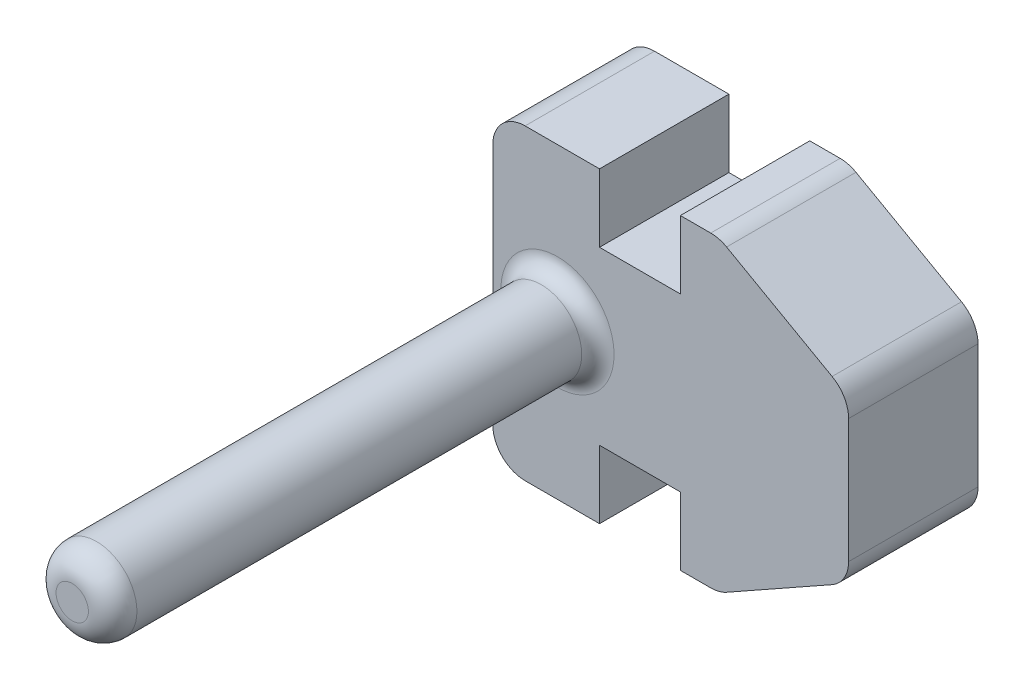
ISO-10303-21;
HEADER;
FILE_DESCRIPTION(('STEP AP214'),'2;1');
FILE_NAME('part.step','',(''),(''),'','','');
FILE_SCHEMA(('AUTOMOTIVE_DESIGN { 1 0 10303 214 1 1 1 1 }'));
ENDSEC;
DATA;
#1=APPLICATION_CONTEXT('core data for automotive mechanical design processes');
#2=APPLICATION_PROTOCOL_DEFINITION('international standard','automotive_design',2000,#1);
#3=PRODUCT_CONTEXT('',#1,'mechanical');
#4=PRODUCT('Part','Part','',(#3));
#5=PRODUCT_RELATED_PRODUCT_CATEGORY('part','',(#4));
#6=PRODUCT_DEFINITION_FORMATION('','',#4);
#7=PRODUCT_DEFINITION_CONTEXT('part definition',#1,'design');
#8=PRODUCT_DEFINITION('design','',#6,#7);
#9=PRODUCT_DEFINITION_SHAPE('','',#8);
#10=(LENGTH_UNIT() NAMED_UNIT(*) SI_UNIT(.MILLI.,.METRE.));
#11=(NAMED_UNIT(*) PLANE_ANGLE_UNIT() SI_UNIT($,.RADIAN.));
#12=(NAMED_UNIT(*) SI_UNIT($,.STERADIAN.) SOLID_ANGLE_UNIT());
#13=UNCERTAINTY_MEASURE_WITH_UNIT(LENGTH_MEASURE(1.E-05),#10,'distance_accuracy_value','');
#14=(GEOMETRIC_REPRESENTATION_CONTEXT(3) GLOBAL_UNCERTAINTY_ASSIGNED_CONTEXT((#13)) GLOBAL_UNIT_ASSIGNED_CONTEXT((#10,
#11,#12)) REPRESENTATION_CONTEXT('',''));
#15=CARTESIAN_POINT('',(0.,0.,0.));
#16=DIRECTION('',(0.,0.,1.));
#17=DIRECTION('',(1.,0.,0.));
#18=AXIS2_PLACEMENT_3D('',#15,#16,#17);
#19=CARTESIAN_POINT('',(2.3,0.,4.));
#20=DIRECTION('',(-1.,0.,0.));
#21=DIRECTION('',(0.,0.,1.));
#22=AXIS2_PLACEMENT_3D('',#19,#20,#21);
#23=PLANE('',#22);
#24=DIRECTION('',(0.,1.,0.));
#25=VECTOR('',#24,1.);
#26=CARTESIAN_POINT('',(2.3,0.,0.));
#27=LINE('',#26,#25);
#28=CARTESIAN_POINT('',(2.3,-4.75,0.));
#29=VERTEX_POINT('',#28);
#30=CARTESIAN_POINT('',(2.3,-2.65,0.));
#31=VERTEX_POINT('',#30);
#32=EDGE_CURVE('E194',#29,#31,#27,.T.);
#33=ORIENTED_EDGE('',*,*,#32,.F.);
#34=DIRECTION('',(0.,0.,-1.));
#35=VECTOR('',#34,1.);
#36=CARTESIAN_POINT('',(2.3,-4.75,4.));
#37=LINE('',#36,#35);
#38=CARTESIAN_POINT('',(2.3,-4.75,4.));
#39=VERTEX_POINT('',#38);
#40=EDGE_CURVE('E181',#39,#29,#37,.T.);
#41=ORIENTED_EDGE('',*,*,#40,.F.);
#42=DIRECTION('',(0.,1.,0.));
#43=VECTOR('',#42,1.);
#44=CARTESIAN_POINT('',(2.3,0.,4.));
#45=LINE('',#44,#43);
#46=CARTESIAN_POINT('',(2.3,-2.65,4.));
#47=VERTEX_POINT('',#46);
#48=EDGE_CURVE('E188',#39,#47,#45,.T.);
#49=ORIENTED_EDGE('',*,*,#48,.T.);
#50=DIRECTION('',(0.,0.,-1.));
#51=VECTOR('',#50,1.);
#52=CARTESIAN_POINT('',(2.3,-2.65,4.));
#53=LINE('',#52,#51);
#54=EDGE_CURVE('E227',#47,#31,#53,.T.);
#55=ORIENTED_EDGE('',*,*,#54,.T.);
#56=EDGE_LOOP('',(#33,#41,#49,#55));
#57=FACE_BOUND('',#56,.T.);
#58=ADVANCED_FACE('F38',(#57),#23,.T.);
#59=CARTESIAN_POINT('',(0.,-4.75,4.));
#60=DIRECTION('',(0.,-1.,0.));
#61=DIRECTION('',(1.,0.,0.));
#62=AXIS2_PLACEMENT_3D('',#59,#60,#61);
#63=PLANE('',#62);
#64=DIRECTION('',(-1.,0.,0.));
#65=VECTOR('',#64,1.);
#66=CARTESIAN_POINT('',(0.,-4.75,0.));
#67=LINE('',#66,#65);
#68=CARTESIAN_POINT('',(3.23804891659047,-4.75,0.));
#69=VERTEX_POINT('',#68);
#70=EDGE_CURVE('E229',#69,#29,#67,.T.);
#71=ORIENTED_EDGE('',*,*,#70,.F.);
#72=DIRECTION('',(0.,0.,-1.));
#73=VECTOR('',#72,1.);
#74=CARTESIAN_POINT('',(3.23804891659047,-4.75,4.));
#75=LINE('',#74,#73);
#76=CARTESIAN_POINT('',(3.23804891659047,-4.75,4.));
#77=VERTEX_POINT('',#76);
#78=EDGE_CURVE('E184',#69,#77,#75,.F.);
#79=ORIENTED_EDGE('',*,*,#78,.T.);
#80=DIRECTION('',(-1.,0.,0.));
#81=VECTOR('',#80,1.);
#82=CARTESIAN_POINT('',(0.,-4.75,4.));
#83=LINE('',#82,#81);
#84=EDGE_CURVE('E177',#77,#39,#83,.T.);
#85=ORIENTED_EDGE('',*,*,#84,.T.);
#86=ORIENTED_EDGE('',*,*,#40,.T.);
#87=EDGE_LOOP('',(#71,#79,#85,#86));
#88=FACE_BOUND('',#87,.T.);
#89=ADVANCED_FACE('F180',(#88),#63,.T.);
#90=CARTESIAN_POINT('',(0.,4.75,4.));
#91=DIRECTION('',(0.,-1.,0.));
#92=DIRECTION('',(0.,0.,-1.));
#93=AXIS2_PLACEMENT_3D('',#90,#91,#92);
#94=PLANE('',#93);
#95=DIRECTION('',(-1.,0.,0.));
#96=VECTOR('',#95,1.);
#97=CARTESIAN_POINT('',(0.,4.75,4.));
#98=LINE('',#97,#96);
#99=CARTESIAN_POINT('',(3.23804891659046,4.75,4.));
#100=VERTEX_POINT('',#99);
#101=CARTESIAN_POINT('',(2.3,4.75,4.));
#102=VERTEX_POINT('',#101);
#103=EDGE_CURVE('E187',#100,#102,#98,.T.);
#104=ORIENTED_EDGE('',*,*,#103,.F.);
#105=DIRECTION('',(0.,0.,-1.));
#106=VECTOR('',#105,1.);
#107=CARTESIAN_POINT('',(3.23804891659046,4.75,0.));
#108=LINE('',#107,#106);
#109=CARTESIAN_POINT('',(3.23804891659046,4.75,0.));
#110=VERTEX_POINT('',#109);
#111=EDGE_CURVE('E195',#100,#110,#108,.T.);
#112=ORIENTED_EDGE('',*,*,#111,.T.);
#113=DIRECTION('',(-1.,0.,0.));
#114=VECTOR('',#113,1.);
#115=CARTESIAN_POINT('',(0.,4.75,0.));
#116=LINE('',#115,#114);
#117=CARTESIAN_POINT('',(2.3,4.75,0.));
#118=VERTEX_POINT('',#117);
#119=EDGE_CURVE('E232',#110,#118,#116,.T.);
#120=ORIENTED_EDGE('',*,*,#119,.T.);
#121=DIRECTION('',(0.,0.,-1.));
#122=VECTOR('',#121,1.);
#123=CARTESIAN_POINT('',(2.3,4.75,4.));
#124=LINE('',#123,#122);
#125=EDGE_CURVE('E196',#102,#118,#124,.T.);
#126=ORIENTED_EDGE('',*,*,#125,.F.);
#127=EDGE_LOOP('',(#104,#112,#120,#126));
#128=FACE_BOUND('',#127,.T.);
#129=ADVANCED_FACE('F337',(#128),#94,.F.);
#130=CARTESIAN_POINT('',(2.3,0.,4.));
#131=DIRECTION('',(1.,0.,0.));
#132=DIRECTION('',(0.,1.,0.));
#133=AXIS2_PLACEMENT_3D('',#130,#131,#132);
#134=PLANE('',#133);
#135=DIRECTION('',(0.,-1.,0.));
#136=VECTOR('',#135,1.);
#137=CARTESIAN_POINT('',(2.3,0.,0.));
#138=LINE('',#137,#136);
#139=CARTESIAN_POINT('',(2.3,2.65,0.));
#140=VERTEX_POINT('',#139);
#141=EDGE_CURVE('E235',#118,#140,#138,.T.);
#142=ORIENTED_EDGE('',*,*,#141,.T.);
#143=DIRECTION('',(0.,0.,-1.));
#144=VECTOR('',#143,1.);
#145=CARTESIAN_POINT('',(2.3,2.65,4.));
#146=LINE('',#145,#144);
#147=CARTESIAN_POINT('',(2.3,2.65,4.));
#148=VERTEX_POINT('',#147);
#149=EDGE_CURVE('E259',#148,#140,#146,.T.);
#150=ORIENTED_EDGE('',*,*,#149,.F.);
#151=DIRECTION('',(0.,-1.,0.));
#152=VECTOR('',#151,1.);
#153=CARTESIAN_POINT('',(2.3,0.,4.));
#154=LINE('',#153,#152);
#155=EDGE_CURVE('E213',#102,#148,#154,.T.);
#156=ORIENTED_EDGE('',*,*,#155,.F.);
#157=ORIENTED_EDGE('',*,*,#125,.T.);
#158=EDGE_LOOP('',(#142,#150,#156,#157));
#159=FACE_BOUND('',#158,.T.);
#160=ADVANCED_FACE('F342',(#159),#134,.F.);
#161=CARTESIAN_POINT('',(0.,2.65,4.));
#162=DIRECTION('',(0.,1.,0.));
#163=DIRECTION('',(-1.,0.,0.));
#164=AXIS2_PLACEMENT_3D('',#161,#162,#163);
#165=PLANE('',#164);
#166=DIRECTION('',(1.,0.,0.));
#167=VECTOR('',#166,1.);
#168=CARTESIAN_POINT('',(0.,2.65,0.));
#169=LINE('',#168,#167);
#170=CARTESIAN_POINT('',(-0.2,2.65,0.));
#171=VERTEX_POINT('',#170);
#172=EDGE_CURVE('E239',#171,#140,#169,.T.);
#173=ORIENTED_EDGE('',*,*,#172,.F.);
#174=DIRECTION('',(0.,0.,-1.));
#175=VECTOR('',#174,1.);
#176=CARTESIAN_POINT('',(-0.2,2.65,4.));
#177=LINE('',#176,#175);
#178=CARTESIAN_POINT('',(-0.2,2.65,4.));
#179=VERTEX_POINT('',#178);
#180=EDGE_CURVE('E257',#179,#171,#177,.T.);
#181=ORIENTED_EDGE('',*,*,#180,.F.);
#182=DIRECTION('',(1.,0.,0.));
#183=VECTOR('',#182,1.);
#184=CARTESIAN_POINT('',(0.,2.65,4.));
#185=LINE('',#184,#183);
#186=EDGE_CURVE('E216',#179,#148,#185,.T.);
#187=ORIENTED_EDGE('',*,*,#186,.T.);
#188=ORIENTED_EDGE('',*,*,#149,.T.);
#189=EDGE_LOOP('',(#173,#181,#187,#188));
#190=FACE_BOUND('',#189,.T.);
#191=ADVANCED_FACE('F437',(#190),#165,.T.);
#192=CARTESIAN_POINT('',(-0.2,0.,4.));
#193=DIRECTION('',(1.,0.,0.));
#194=DIRECTION('',(0.,1.,0.));
#195=AXIS2_PLACEMENT_3D('',#192,#193,#194);
#196=PLANE('',#195);
#197=DIRECTION('',(0.,-1.,0.));
#198=VECTOR('',#197,1.);
#199=CARTESIAN_POINT('',(-0.2,0.,0.));
#200=LINE('',#199,#198);
#201=CARTESIAN_POINT('',(-0.200000000000001,4.75,0.));
#202=VERTEX_POINT('',#201);
#203=EDGE_CURVE('E242',#202,#171,#200,.T.);
#204=ORIENTED_EDGE('',*,*,#203,.F.);
#205=DIRECTION('',(0.,0.,-1.));
#206=VECTOR('',#205,1.);
#207=CARTESIAN_POINT('',(-0.200000000000001,4.75,4.));
#208=LINE('',#207,#206);
#209=CARTESIAN_POINT('',(-0.200000000000001,4.75,4.));
#210=VERTEX_POINT('',#209);
#211=EDGE_CURVE('E255',#210,#202,#208,.T.);
#212=ORIENTED_EDGE('',*,*,#211,.F.);
#213=DIRECTION('',(0.,-1.,0.));
#214=VECTOR('',#213,1.);
#215=CARTESIAN_POINT('',(-0.2,0.,4.));
#216=LINE('',#215,#214);
#217=EDGE_CURVE('E219',#210,#179,#216,.T.);
#218=ORIENTED_EDGE('',*,*,#217,.T.);
#219=ORIENTED_EDGE('',*,*,#180,.T.);
#220=EDGE_LOOP('',(#204,#212,#218,#219));
#221=FACE_BOUND('',#220,.T.);
#222=ADVANCED_FACE('F432',(#221),#196,.T.);
#223=CARTESIAN_POINT('',(-2.5,4.75,0.));
#224=VERTEX_POINT('',#223);
#225=EDGE_CURVE('E236',#202,#224,#116,.T.);
#226=ORIENTED_EDGE('',*,*,#225,.T.);
#227=DIRECTION('',(0.,0.,-1.));
#228=VECTOR('',#227,1.);
#229=CARTESIAN_POINT('',(-2.5,4.75,4.));
#230=LINE('',#229,#228);
#231=CARTESIAN_POINT('',(-2.5,4.75,4.));
#232=VERTEX_POINT('',#231);
#233=EDGE_CURVE('E311',#224,#232,#230,.F.);
#234=ORIENTED_EDGE('',*,*,#233,.T.);
#235=EDGE_CURVE('E214',#210,#232,#98,.T.);
#236=ORIENTED_EDGE('',*,*,#235,.F.);
#237=ORIENTED_EDGE('',*,*,#211,.T.);
#238=EDGE_LOOP('',(#226,#234,#236,#237));
#239=FACE_BOUND('',#238,.T.);
#240=ADVANCED_FACE('F436',(#239),#94,.F.);
#241=CARTESIAN_POINT('',(-3.5,0.,4.));
#242=DIRECTION('',(-1.,0.,0.));
#243=DIRECTION('',(0.,0.,1.));
#244=AXIS2_PLACEMENT_3D('',#241,#242,#243);
#245=PLANE('',#244);
#246=DIRECTION('',(0.,1.,0.));
#247=VECTOR('',#246,1.);
#248=CARTESIAN_POINT('',(-3.5,0.,0.));
#249=LINE('',#248,#247);
#250=CARTESIAN_POINT('',(-3.5,-3.75,0.));
#251=VERTEX_POINT('',#250);
#252=CARTESIAN_POINT('',(-3.5,3.75,0.));
#253=VERTEX_POINT('',#252);
#254=EDGE_CURVE('E245',#251,#253,#249,.T.);
#255=ORIENTED_EDGE('',*,*,#254,.F.);
#256=DIRECTION('',(0.,0.,-1.));
#257=VECTOR('',#256,1.);
#258=CARTESIAN_POINT('',(-3.5,-3.75,4.));
#259=LINE('',#258,#257);
#260=CARTESIAN_POINT('',(-3.5,-3.75,4.));
#261=VERTEX_POINT('',#260);
#262=EDGE_CURVE('E309',#251,#261,#259,.F.);
#263=ORIENTED_EDGE('',*,*,#262,.T.);
#264=DIRECTION('',(0.,1.,0.));
#265=VECTOR('',#264,1.);
#266=CARTESIAN_POINT('',(-3.5,0.,4.));
#267=LINE('',#266,#265);
#268=CARTESIAN_POINT('',(-3.5,3.75,4.));
#269=VERTEX_POINT('',#268);
#270=EDGE_CURVE('E222',#261,#269,#267,.T.);
#271=ORIENTED_EDGE('',*,*,#270,.T.);
#272=DIRECTION('',(0.,0.,-1.));
#273=VECTOR('',#272,1.);
#274=CARTESIAN_POINT('',(-3.5,3.75,0.));
#275=LINE('',#274,#273);
#276=EDGE_CURVE('E306',#269,#253,#275,.T.);
#277=ORIENTED_EDGE('',*,*,#276,.T.);
#278=EDGE_LOOP('',(#255,#263,#271,#277));
#279=FACE_BOUND('',#278,.T.);
#280=ADVANCED_FACE('F372',(#279),#245,.T.);
#281=CARTESIAN_POINT('',(-0.200000000000001,-4.75,4.));
#282=VERTEX_POINT('',#281);
#283=CARTESIAN_POINT('',(-2.5,-4.75,4.));
#284=VERTEX_POINT('',#283);
#285=EDGE_CURVE('E190',#282,#284,#83,.T.);
#286=ORIENTED_EDGE('',*,*,#285,.T.);
#287=DIRECTION('',(0.,0.,-1.));
#288=VECTOR('',#287,1.);
#289=CARTESIAN_POINT('',(-2.5,-4.75,4.));
#290=LINE('',#289,#288);
#291=CARTESIAN_POINT('',(-2.5,-4.75,0.));
#292=VERTEX_POINT('',#291);
#293=EDGE_CURVE('E303',#284,#292,#290,.T.);
#294=ORIENTED_EDGE('',*,*,#293,.T.);
#295=CARTESIAN_POINT('',(-0.200000000000001,-4.75,0.));
#296=VERTEX_POINT('',#295);
#297=EDGE_CURVE('E233',#296,#292,#67,.T.);
#298=ORIENTED_EDGE('',*,*,#297,.F.);
#299=DIRECTION('',(0.,0.,-1.));
#300=VECTOR('',#299,1.);
#301=CARTESIAN_POINT('',(-0.200000000000001,-4.75,4.));
#302=LINE('',#301,#300);
#303=EDGE_CURVE('E253',#282,#296,#302,.T.);
#304=ORIENTED_EDGE('',*,*,#303,.F.);
#305=EDGE_LOOP('',(#286,#294,#298,#304));
#306=FACE_BOUND('',#305,.T.);
#307=ADVANCED_FACE('F339',(#306),#63,.T.);
#308=CARTESIAN_POINT('',(-0.200000000000001,0.,4.));
#309=DIRECTION('',(-1.,0.,0.));
#310=DIRECTION('',(0.,0.,1.));
#311=AXIS2_PLACEMENT_3D('',#308,#309,#310);
#312=PLANE('',#311);
#313=DIRECTION('',(0.,1.,0.));
#314=VECTOR('',#313,1.);
#315=CARTESIAN_POINT('',(-0.200000000000001,0.,0.));
#316=LINE('',#315,#314);
#317=CARTESIAN_POINT('',(-0.200000000000001,-2.65,0.));
#318=VERTEX_POINT('',#317);
#319=EDGE_CURVE('E206',#296,#318,#316,.T.);
#320=ORIENTED_EDGE('',*,*,#319,.T.);
#321=DIRECTION('',(0.,0.,-1.));
#322=VECTOR('',#321,1.);
#323=CARTESIAN_POINT('',(-0.200000000000001,-2.65,4.));
#324=LINE('',#323,#322);
#325=CARTESIAN_POINT('',(-0.200000000000001,-2.65,4.));
#326=VERTEX_POINT('',#325);
#327=EDGE_CURVE('E250',#326,#318,#324,.T.);
#328=ORIENTED_EDGE('',*,*,#327,.F.);
#329=DIRECTION('',(0.,1.,0.));
#330=VECTOR('',#329,1.);
#331=CARTESIAN_POINT('',(-0.200000000000001,0.,4.));
#332=LINE('',#331,#330);
#333=EDGE_CURVE('E224',#282,#326,#332,.T.);
#334=ORIENTED_EDGE('',*,*,#333,.F.);
#335=ORIENTED_EDGE('',*,*,#303,.T.);
#336=EDGE_LOOP('',(#320,#328,#334,#335));
#337=FACE_BOUND('',#336,.T.);
#338=ADVANCED_FACE('F387',(#337),#312,.F.);
#339=CARTESIAN_POINT('',(0.,-2.65,4.));
#340=DIRECTION('',(0.,1.,0.));
#341=DIRECTION('',(0.,0.,1.));
#342=AXIS2_PLACEMENT_3D('',#339,#340,#341);
#343=PLANE('',#342);
#344=DIRECTION('',(1.,0.,0.));
#345=VECTOR('',#344,1.);
#346=CARTESIAN_POINT('',(0.,-2.65,0.));
#347=LINE('',#346,#345);
#348=EDGE_CURVE('E203',#318,#31,#347,.T.);
#349=ORIENTED_EDGE('',*,*,#348,.T.);
#350=ORIENTED_EDGE('',*,*,#54,.F.);
#351=DIRECTION('',(1.,0.,0.));
#352=VECTOR('',#351,1.);
#353=CARTESIAN_POINT('',(0.,-2.65,4.));
#354=LINE('',#353,#352);
#355=EDGE_CURVE('E201',#326,#47,#354,.T.);
#356=ORIENTED_EDGE('',*,*,#355,.F.);
#357=ORIENTED_EDGE('',*,*,#327,.T.);
#358=EDGE_LOOP('',(#349,#350,#356,#357));
#359=FACE_BOUND('',#358,.T.);
#360=ADVANCED_FACE('F390',(#359),#343,.F.);
#361=CARTESIAN_POINT('',(0.,0.,4.));
#362=DIRECTION('',(0.,0.,1.));
#363=DIRECTION('',(1.,0.,0.));
#364=AXIS2_PLACEMENT_3D('',#361,#362,#363);
#365=PLANE('',#364);
#366=CARTESIAN_POINT('',(-1.5,0.,4.));
#367=DIRECTION('',(0.,0.,1.));
#368=DIRECTION('',(1.,0.,0.));
#369=AXIS2_PLACEMENT_3D('',#366,#367,#368);
#370=CIRCLE('',#369,1.75);
#371=CARTESIAN_POINT('',(0.25,0.,4.));
#372=VERTEX_POINT('',#371);
#373=EDGE_CURVE('E316',#372,#372,#370,.F.);
#374=ORIENTED_EDGE('',*,*,#373,.T.);
#375=EDGE_LOOP('',(#374));
#376=FACE_BOUND('',#375,.T.);
#377=DIRECTION('',(0.871575537124549,-0.490261239632559,0.));
#378=VECTOR('',#377,1.);
#379=CARTESIAN_POINT('',(2.87091988130564,5.10385756676558,4.));
#380=LINE('',#379,#378);
#381=CARTESIAN_POINT('',(3.72831015622302,4.62157553712455,4.));
#382=VERTEX_POINT('',#381);
#383=CARTESIAN_POINT('',(6.99026123963256,2.78672805270669,4.));
#384=VERTEX_POINT('',#383);
#385=EDGE_CURVE('E230',#382,#384,#380,.T.);
#386=ORIENTED_EDGE('',*,*,#385,.F.);
#387=CARTESIAN_POINT('',(3.23804891659046,3.75,4.));
#388=DIRECTION('',(0.,0.,1.));
#389=DIRECTION('',(1.,0.,0.));
#390=AXIS2_PLACEMENT_3D('',#387,#388,#389);
#391=CIRCLE('',#390,1.);
#392=EDGE_CURVE('E290',#382,#100,#391,.T.);
#393=ORIENTED_EDGE('',*,*,#392,.T.);
#394=ORIENTED_EDGE('',*,*,#103,.T.);
#395=ORIENTED_EDGE('',*,*,#155,.T.);
#396=ORIENTED_EDGE('',*,*,#186,.F.);
#397=ORIENTED_EDGE('',*,*,#217,.F.);
#398=ORIENTED_EDGE('',*,*,#235,.T.);
#399=CARTESIAN_POINT('',(-2.5,3.75,4.));
#400=DIRECTION('',(0.,0.,1.));
#401=DIRECTION('',(1.,0.,0.));
#402=AXIS2_PLACEMENT_3D('',#399,#400,#401);
#403=CIRCLE('',#402,1.);
#404=EDGE_CURVE('E59',#232,#269,#403,.T.);
#405=ORIENTED_EDGE('',*,*,#404,.T.);
#406=ORIENTED_EDGE('',*,*,#270,.F.);
#407=CARTESIAN_POINT('',(-2.5,-3.75,4.));
#408=DIRECTION('',(0.,0.,1.));
#409=DIRECTION('',(1.,0.,0.));
#410=AXIS2_PLACEMENT_3D('',#407,#408,#409);
#411=CIRCLE('',#410,1.);
#412=EDGE_CURVE('E53',#261,#284,#411,.T.);
#413=ORIENTED_EDGE('',*,*,#412,.T.);
#414=ORIENTED_EDGE('',*,*,#285,.F.);
#415=ORIENTED_EDGE('',*,*,#333,.T.);
#416=ORIENTED_EDGE('',*,*,#355,.T.);
#417=ORIENTED_EDGE('',*,*,#48,.F.);
#418=ORIENTED_EDGE('',*,*,#84,.F.);
#419=CARTESIAN_POINT('',(3.23804891659047,-3.75,4.));
#420=DIRECTION('',(0.,0.,1.));
#421=DIRECTION('',(1.,0.,0.));
#422=AXIS2_PLACEMENT_3D('',#419,#420,#421);
#423=CIRCLE('',#422,1.);
#424=CARTESIAN_POINT('',(3.72831015622302,-4.62157553712455,4.));
#425=VERTEX_POINT('',#424);
#426=EDGE_CURVE('E284',#77,#425,#423,.T.);
#427=ORIENTED_EDGE('',*,*,#426,.T.);
#428=DIRECTION('',(-0.871575537124549,-0.490261239632559,0.));
#429=VECTOR('',#428,1.);
#430=CARTESIAN_POINT('',(2.87091988130564,-5.10385756676558,4.));
#431=LINE('',#430,#429);
#432=CARTESIAN_POINT('',(6.99026123963256,-2.78672805270668,4.));
#433=VERTEX_POINT('',#432);
#434=EDGE_CURVE('E395',#433,#425,#431,.T.);
#435=ORIENTED_EDGE('',*,*,#434,.F.);
#436=CARTESIAN_POINT('',(6.5,-1.91515251558214,4.));
#437=DIRECTION('',(0.,0.,1.));
#438=DIRECTION('',(1.,0.,0.));
#439=AXIS2_PLACEMENT_3D('',#436,#437,#438);
#440=CIRCLE('',#439,1.);
#441=CARTESIAN_POINT('',(7.5,-1.91515251558214,4.));
#442=VERTEX_POINT('',#441);
#443=EDGE_CURVE('E286',#433,#442,#440,.T.);
#444=ORIENTED_EDGE('',*,*,#443,.T.);
#445=DIRECTION('',(0.,-1.,0.));
#446=VECTOR('',#445,1.);
#447=CARTESIAN_POINT('',(7.5,0.,4.));
#448=LINE('',#447,#446);
#449=CARTESIAN_POINT('',(7.5,1.91515251558214,4.));
#450=VERTEX_POINT('',#449);
#451=EDGE_CURVE('E401',#450,#442,#448,.T.);
#452=ORIENTED_EDGE('',*,*,#451,.F.);
#453=CARTESIAN_POINT('',(6.5,1.91515251558214,4.));
#454=DIRECTION('',(0.,0.,1.));
#455=DIRECTION('',(1.,0.,0.));
#456=AXIS2_PLACEMENT_3D('',#453,#454,#455);
#457=CIRCLE('',#456,1.);
#458=EDGE_CURVE('E288',#450,#384,#457,.T.);
#459=ORIENTED_EDGE('',*,*,#458,.T.);
#460=EDGE_LOOP('',(#386,#393,#394,#395,#396,#397,#398,#405,#406,#413,#414,#415,#416,#417,#418,
#427,#435,#444,#452,#459));
#461=FACE_BOUND('',#460,.T.);
#462=ADVANCED_FACE('F199',(#376,#461),#365,.T.);
#463=CARTESIAN_POINT('',(0.,0.,0.));
#464=DIRECTION('',(0.,0.,1.));
#465=DIRECTION('',(1.,0.,0.));
#466=AXIS2_PLACEMENT_3D('',#463,#464,#465);
#467=PLANE('',#466);
#468=ORIENTED_EDGE('',*,*,#119,.F.);
#469=CARTESIAN_POINT('',(3.23804891659046,3.75,0.));
#470=DIRECTION('',(0.,0.,1.));
#471=DIRECTION('',(1.,0.,0.));
#472=AXIS2_PLACEMENT_3D('',#469,#470,#471);
#473=CIRCLE('',#472,1.);
#474=CARTESIAN_POINT('',(3.72831015622302,4.62157553712455,0.));
#475=VERTEX_POINT('',#474);
#476=EDGE_CURVE('E275',#110,#475,#473,.F.);
#477=ORIENTED_EDGE('',*,*,#476,.T.);
#478=DIRECTION('',(0.871575537124549,-0.490261239632559,0.));
#479=VECTOR('',#478,1.);
#480=CARTESIAN_POINT('',(2.87091988130564,5.10385756676558,0.));
#481=LINE('',#480,#479);
#482=CARTESIAN_POINT('',(6.99026123963256,2.78672805270669,0.));
#483=VERTEX_POINT('',#482);
#484=EDGE_CURVE('E209',#475,#483,#481,.T.);
#485=ORIENTED_EDGE('',*,*,#484,.T.);
#486=CARTESIAN_POINT('',(6.5,1.91515251558214,0.));
#487=DIRECTION('',(0.,0.,1.));
#488=DIRECTION('',(1.,0.,0.));
#489=AXIS2_PLACEMENT_3D('',#486,#487,#488);
#490=CIRCLE('',#489,1.);
#491=CARTESIAN_POINT('',(7.5,1.91515251558214,0.));
#492=VERTEX_POINT('',#491);
#493=EDGE_CURVE('E273',#483,#492,#490,.F.);
#494=ORIENTED_EDGE('',*,*,#493,.T.);
#495=DIRECTION('',(0.,-1.,0.));
#496=VECTOR('',#495,1.);
#497=CARTESIAN_POINT('',(7.5,0.,0.));
#498=LINE('',#497,#496);
#499=CARTESIAN_POINT('',(7.5,-1.91515251558214,0.));
#500=VERTEX_POINT('',#499);
#501=EDGE_CURVE('E408',#492,#500,#498,.T.);
#502=ORIENTED_EDGE('',*,*,#501,.T.);
#503=CARTESIAN_POINT('',(6.5,-1.91515251558214,0.));
#504=DIRECTION('',(0.,0.,1.));
#505=DIRECTION('',(1.,0.,0.));
#506=AXIS2_PLACEMENT_3D('',#503,#504,#505);
#507=CIRCLE('',#506,1.);
#508=CARTESIAN_POINT('',(6.99026123963256,-2.78672805270668,0.));
#509=VERTEX_POINT('',#508);
#510=EDGE_CURVE('E271',#500,#509,#507,.F.);
#511=ORIENTED_EDGE('',*,*,#510,.T.);
#512=DIRECTION('',(-0.871575537124549,-0.490261239632559,0.));
#513=VECTOR('',#512,1.);
#514=CARTESIAN_POINT('',(2.87091988130564,-5.10385756676558,0.));
#515=LINE('',#514,#513);
#516=CARTESIAN_POINT('',(3.72831015622302,-4.62157553712455,0.));
#517=VERTEX_POINT('',#516);
#518=EDGE_CURVE('E410',#509,#517,#515,.T.);
#519=ORIENTED_EDGE('',*,*,#518,.T.);
#520=CARTESIAN_POINT('',(3.23804891659047,-3.75,0.));
#521=DIRECTION('',(0.,0.,1.));
#522=DIRECTION('',(1.,0.,0.));
#523=AXIS2_PLACEMENT_3D('',#520,#521,#522);
#524=CIRCLE('',#523,1.);
#525=EDGE_CURVE('E269',#517,#69,#524,.F.);
#526=ORIENTED_EDGE('',*,*,#525,.T.);
#527=ORIENTED_EDGE('',*,*,#70,.T.);
#528=ORIENTED_EDGE('',*,*,#32,.T.);
#529=ORIENTED_EDGE('',*,*,#348,.F.);
#530=ORIENTED_EDGE('',*,*,#319,.F.);
#531=ORIENTED_EDGE('',*,*,#297,.T.);
#532=CARTESIAN_POINT('',(-2.5,-3.75,0.));
#533=DIRECTION('',(0.,0.,1.));
#534=DIRECTION('',(1.,0.,0.));
#535=AXIS2_PLACEMENT_3D('',#532,#533,#534);
#536=CIRCLE('',#535,1.);
#537=EDGE_CURVE('E267',#292,#251,#536,.F.);
#538=ORIENTED_EDGE('',*,*,#537,.T.);
#539=ORIENTED_EDGE('',*,*,#254,.T.);
#540=CARTESIAN_POINT('',(-2.5,3.75,0.));
#541=DIRECTION('',(0.,0.,1.));
#542=DIRECTION('',(1.,0.,0.));
#543=AXIS2_PLACEMENT_3D('',#540,#541,#542);
#544=CIRCLE('',#543,1.);
#545=EDGE_CURVE('E265',#253,#224,#544,.F.);
#546=ORIENTED_EDGE('',*,*,#545,.T.);
#547=ORIENTED_EDGE('',*,*,#225,.F.);
#548=ORIENTED_EDGE('',*,*,#203,.T.);
#549=ORIENTED_EDGE('',*,*,#172,.T.);
#550=ORIENTED_EDGE('',*,*,#141,.F.);
#551=EDGE_LOOP('',(#468,#477,#485,#494,#502,#511,#519,#526,#527,#528,#529,#530,#531,#538,#539,
#546,#547,#548,#549,#550));
#552=FACE_BOUND('',#551,.T.);
#553=ADVANCED_FACE('F376',(#552),#467,.F.);
#554=CARTESIAN_POINT('',(7.5,0.,4.));
#555=DIRECTION('',(1.,0.,0.));
#556=DIRECTION('',(0.,0.,-1.));
#557=AXIS2_PLACEMENT_3D('',#554,#555,#556);
#558=PLANE('',#557);
#559=ORIENTED_EDGE('',*,*,#501,.F.);
#560=DIRECTION('',(0.,0.,-1.));
#561=VECTOR('',#560,1.);
#562=CARTESIAN_POINT('',(7.5,1.91515251558214,4.));
#563=LINE('',#562,#561);
#564=EDGE_CURVE('E295',#492,#450,#563,.F.);
#565=ORIENTED_EDGE('',*,*,#564,.T.);
#566=ORIENTED_EDGE('',*,*,#451,.T.);
#567=DIRECTION('',(0.,0.,-1.));
#568=VECTOR('',#567,1.);
#569=CARTESIAN_POINT('',(7.5,-1.91515251558214,4.));
#570=LINE('',#569,#568);
#571=EDGE_CURVE('E292',#442,#500,#570,.T.);
#572=ORIENTED_EDGE('',*,*,#571,.T.);
#573=EDGE_LOOP('',(#559,#565,#566,#572));
#574=FACE_BOUND('',#573,.T.);
#575=ADVANCED_FACE('F456',(#574),#558,.T.);
#576=CARTESIAN_POINT('',(2.87091988130564,5.10385756676558,4.));
#577=DIRECTION('',(0.490261239632559,0.871575537124549,0.));
#578=DIRECTION('',(-0.871575537124549,0.490261239632559,0.));
#579=AXIS2_PLACEMENT_3D('',#576,#577,#578);
#580=PLANE('',#579);
#581=ORIENTED_EDGE('',*,*,#484,.F.);
#582=DIRECTION('',(0.,0.,-1.));
#583=VECTOR('',#582,1.);
#584=CARTESIAN_POINT('',(3.72831015622302,4.62157553712455,4.));
#585=LINE('',#584,#583);
#586=EDGE_CURVE('E280',#475,#382,#585,.F.);
#587=ORIENTED_EDGE('',*,*,#586,.T.);
#588=ORIENTED_EDGE('',*,*,#385,.T.);
#589=DIRECTION('',(0.,0.,-1.));
#590=VECTOR('',#589,1.);
#591=CARTESIAN_POINT('',(6.99026123963256,2.78672805270669,4.));
#592=LINE('',#591,#590);
#593=EDGE_CURVE('E277',#384,#483,#592,.T.);
#594=ORIENTED_EDGE('',*,*,#593,.T.);
#595=EDGE_LOOP('',(#581,#587,#588,#594));
#596=FACE_BOUND('',#595,.T.);
#597=ADVANCED_FACE('F416',(#596),#580,.T.);
#598=CARTESIAN_POINT('',(2.87091988130564,-5.10385756676558,4.));
#599=DIRECTION('',(0.490261239632559,-0.871575537124549,0.));
#600=DIRECTION('',(0.871575537124549,0.490261239632559,0.));
#601=AXIS2_PLACEMENT_3D('',#598,#599,#600);
#602=PLANE('',#601);
#603=ORIENTED_EDGE('',*,*,#518,.F.);
#604=DIRECTION('',(0.,0.,-1.));
#605=VECTOR('',#604,1.);
#606=CARTESIAN_POINT('',(6.99026123963256,-2.78672805270668,4.));
#607=LINE('',#606,#605);
#608=EDGE_CURVE('E300',#509,#433,#607,.F.);
#609=ORIENTED_EDGE('',*,*,#608,.T.);
#610=ORIENTED_EDGE('',*,*,#434,.T.);
#611=DIRECTION('',(0.,0.,-1.));
#612=VECTOR('',#611,1.);
#613=CARTESIAN_POINT('',(3.72831015622302,-4.62157553712455,4.));
#614=LINE('',#613,#612);
#615=EDGE_CURVE('E297',#425,#517,#614,.T.);
#616=ORIENTED_EDGE('',*,*,#615,.T.);
#617=EDGE_LOOP('',(#603,#609,#610,#616));
#618=FACE_BOUND('',#617,.T.);
#619=ADVANCED_FACE('F399',(#618),#602,.T.);
#620=CARTESIAN_POINT('',(-1.5,0.,19.));
#621=DIRECTION('',(0.,0.,-1.));
#622=DIRECTION('',(-1.,0.,0.));
#623=AXIS2_PLACEMENT_3D('',#620,#621,#622);
#624=CYLINDRICAL_SURFACE('',#623,1.25);
#625=CARTESIAN_POINT('',(-1.5,0.,18.25));
#626=DIRECTION('',(0.,0.,1.));
#627=DIRECTION('',(1.,0.,0.));
#628=AXIS2_PLACEMENT_3D('',#625,#626,#627);
#629=CIRCLE('',#628,1.25);
#630=CARTESIAN_POINT('',(-0.25,0.,18.25));
#631=VERTEX_POINT('',#630);
#632=EDGE_CURVE('E11',#631,#631,#629,.F.);
#633=ORIENTED_EDGE('',*,*,#632,.T.);
#634=EDGE_LOOP('',(#633));
#635=FACE_BOUND('',#634,.T.);
#636=CARTESIAN_POINT('',(-1.5,0.,4.5));
#637=DIRECTION('',(0.,0.,1.));
#638=DIRECTION('',(1.,0.,0.));
#639=AXIS2_PLACEMENT_3D('',#636,#637,#638);
#640=CIRCLE('',#639,1.25);
#641=CARTESIAN_POINT('',(-0.25,0.,4.5));
#642=VERTEX_POINT('',#641);
#643=EDGE_CURVE('E313',#642,#642,#640,.T.);
#644=ORIENTED_EDGE('',*,*,#643,.T.);
#645=EDGE_LOOP('',(#644));
#646=FACE_BOUND('',#645,.T.);
#647=ADVANCED_FACE('F465',(#635,#646),#624,.T.);
#648=CARTESIAN_POINT('',(0.,0.,19.));
#649=DIRECTION('',(0.,0.,1.));
#650=DIRECTION('',(1.,0.,0.));
#651=AXIS2_PLACEMENT_3D('',#648,#649,#650);
#652=PLANE('',#651);
#653=CARTESIAN_POINT('',(-1.5,0.,19.));
#654=DIRECTION('',(0.,0.,1.));
#655=DIRECTION('',(1.,0.,0.));
#656=AXIS2_PLACEMENT_3D('',#653,#654,#655);
#657=CIRCLE('',#656,0.5);
#658=CARTESIAN_POINT('',(-1.,0.,19.));
#659=VERTEX_POINT('',#658);
#660=EDGE_CURVE('E46',#659,#659,#657,.T.);
#661=ORIENTED_EDGE('',*,*,#660,.T.);
#662=EDGE_LOOP('',(#661));
#663=FACE_BOUND('',#662,.T.);
#664=ADVANCED_FACE('F321',(#663),#652,.T.);
#665=CARTESIAN_POINT('',(3.23804891659046,3.75,4.));
#666=DIRECTION('',(0.,0.,1.));
#667=DIRECTION('',(1.,0.,0.));
#668=AXIS2_PLACEMENT_3D('',#665,#666,#667);
#669=CYLINDRICAL_SURFACE('',#668,1.);
#670=ORIENTED_EDGE('',*,*,#392,.F.);
#671=ORIENTED_EDGE('',*,*,#586,.F.);
#672=ORIENTED_EDGE('',*,*,#476,.F.);
#673=ORIENTED_EDGE('',*,*,#111,.F.);
#674=EDGE_LOOP('',(#670,#671,#672,#673));
#675=FACE_BOUND('',#674,.T.);
#676=ADVANCED_FACE('F344',(#675),#669,.T.);
#677=CARTESIAN_POINT('',(6.5,1.91515251558214,4.));
#678=DIRECTION('',(0.,0.,-1.));
#679=DIRECTION('',(-1.,0.,0.));
#680=AXIS2_PLACEMENT_3D('',#677,#678,#679);
#681=CYLINDRICAL_SURFACE('',#680,1.);
#682=ORIENTED_EDGE('',*,*,#458,.F.);
#683=ORIENTED_EDGE('',*,*,#564,.F.);
#684=ORIENTED_EDGE('',*,*,#493,.F.);
#685=ORIENTED_EDGE('',*,*,#593,.F.);
#686=EDGE_LOOP('',(#682,#683,#684,#685));
#687=FACE_BOUND('',#686,.T.);
#688=ADVANCED_FACE('F347',(#687),#681,.T.);
#689=CARTESIAN_POINT('',(6.5,-1.91515251558214,4.));
#690=DIRECTION('',(0.,0.,-1.));
#691=DIRECTION('',(-1.,0.,0.));
#692=AXIS2_PLACEMENT_3D('',#689,#690,#691);
#693=CYLINDRICAL_SURFACE('',#692,1.);
#694=ORIENTED_EDGE('',*,*,#443,.F.);
#695=ORIENTED_EDGE('',*,*,#608,.F.);
#696=ORIENTED_EDGE('',*,*,#510,.F.);
#697=ORIENTED_EDGE('',*,*,#571,.F.);
#698=EDGE_LOOP('',(#694,#695,#696,#697));
#699=FACE_BOUND('',#698,.T.);
#700=ADVANCED_FACE('F351',(#699),#693,.T.);
#701=CARTESIAN_POINT('',(3.23804891659047,-3.75,4.));
#702=DIRECTION('',(0.,0.,-1.));
#703=DIRECTION('',(-1.,0.,0.));
#704=AXIS2_PLACEMENT_3D('',#701,#702,#703);
#705=CYLINDRICAL_SURFACE('',#704,1.);
#706=ORIENTED_EDGE('',*,*,#426,.F.);
#707=ORIENTED_EDGE('',*,*,#78,.F.);
#708=ORIENTED_EDGE('',*,*,#525,.F.);
#709=ORIENTED_EDGE('',*,*,#615,.F.);
#710=EDGE_LOOP('',(#706,#707,#708,#709));
#711=FACE_BOUND('',#710,.T.);
#712=ADVANCED_FACE('F355',(#711),#705,.T.);
#713=CARTESIAN_POINT('',(-2.5,-3.75,4.));
#714=DIRECTION('',(0.,0.,-1.));
#715=DIRECTION('',(-1.,0.,0.));
#716=AXIS2_PLACEMENT_3D('',#713,#714,#715);
#717=CYLINDRICAL_SURFACE('',#716,1.);
#718=ORIENTED_EDGE('',*,*,#412,.F.);
#719=ORIENTED_EDGE('',*,*,#262,.F.);
#720=ORIENTED_EDGE('',*,*,#537,.F.);
#721=ORIENTED_EDGE('',*,*,#293,.F.);
#722=EDGE_LOOP('',(#718,#719,#720,#721));
#723=FACE_BOUND('',#722,.T.);
#724=ADVANCED_FACE('F359',(#723),#717,.T.);
#725=CARTESIAN_POINT('',(-2.5,3.75,4.));
#726=DIRECTION('',(0.,0.,1.));
#727=DIRECTION('',(1.,0.,0.));
#728=AXIS2_PLACEMENT_3D('',#725,#726,#727);
#729=CYLINDRICAL_SURFACE('',#728,1.);
#730=ORIENTED_EDGE('',*,*,#404,.F.);
#731=ORIENTED_EDGE('',*,*,#233,.F.);
#732=ORIENTED_EDGE('',*,*,#545,.F.);
#733=ORIENTED_EDGE('',*,*,#276,.F.);
#734=EDGE_LOOP('',(#730,#731,#732,#733));
#735=FACE_BOUND('',#734,.T.);
#736=ADVANCED_FACE('F329',(#735),#729,.T.);
#737=CARTESIAN_POINT('',(-1.5,0.,4.5));
#738=DIRECTION('',(0.,0.,1.));
#739=DIRECTION('',(1.,0.,0.));
#740=AXIS2_PLACEMENT_3D('',#737,#738,#739);
#741=TOROIDAL_SURFACE('',#740,1.75,0.5);
#742=ORIENTED_EDGE('',*,*,#373,.F.);
#743=EDGE_LOOP('',(#742));
#744=FACE_BOUND('',#743,.T.);
#745=ORIENTED_EDGE('',*,*,#643,.F.);
#746=EDGE_LOOP('',(#745));
#747=FACE_BOUND('',#746,.T.);
#748=ADVANCED_FACE('F324',(#744,#747),#741,.F.);
#749=CARTESIAN_POINT('',(-1.5,0.,18.25));
#750=DIRECTION('',(0.,0.,1.));
#751=DIRECTION('',(1.,0.,0.));
#752=AXIS2_PLACEMENT_3D('',#749,#750,#751);
#753=DEGENERATE_TOROIDAL_SURFACE('',#752,0.5,0.75,.T.);
#754=ORIENTED_EDGE('',*,*,#632,.F.);
#755=EDGE_LOOP('',(#754));
#756=FACE_BOUND('',#755,.T.);
#757=ORIENTED_EDGE('',*,*,#660,.F.);
#758=EDGE_LOOP('',(#757));
#759=FACE_BOUND('',#758,.T.);
#760=ADVANCED_FACE('F40',(#756,#759),#753,.T.);
#761=CLOSED_SHELL('',(#58,#89,#129,#160,#191,#222,#240,#280,#307,#338,#360,#462,#553,#575,#597,
#619,#647,#664,#676,#688,#700,#712,#724,#736,#748,#760));
#762=MANIFOLD_SOLID_BREP('B2',#761);
#763=ADVANCED_BREP_SHAPE_REPRESENTATION('',(#18,#762),#14);
#764=SHAPE_DEFINITION_REPRESENTATION(#9,#763);
ENDSEC;
END-ISO-10303-21;
